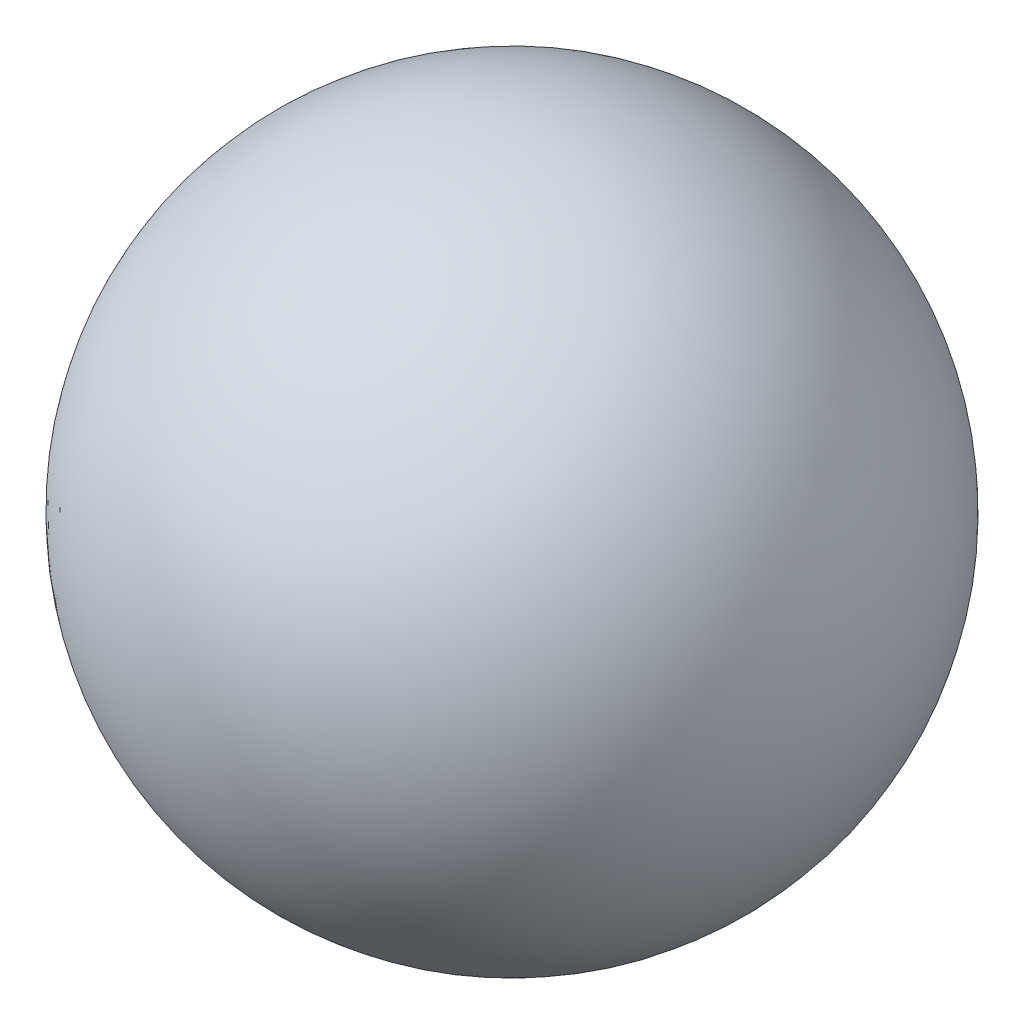
ISO-10303-21;
HEADER;
FILE_DESCRIPTION(('STEP AP214'),'2;1');
FILE_NAME('part.step','',(''),(''),'','','');
FILE_SCHEMA(('AUTOMOTIVE_DESIGN { 1 0 10303 214 1 1 1 1 }'));
ENDSEC;
DATA;
#1=APPLICATION_CONTEXT('core data for automotive mechanical design processes');
#2=APPLICATION_PROTOCOL_DEFINITION('international standard','automotive_design',2000,#1);
#3=PRODUCT_CONTEXT('',#1,'mechanical');
#4=PRODUCT('Part','Part','',(#3));
#5=PRODUCT_RELATED_PRODUCT_CATEGORY('part','',(#4));
#6=PRODUCT_DEFINITION_FORMATION('','',#4);
#7=PRODUCT_DEFINITION_CONTEXT('part definition',#1,'design');
#8=PRODUCT_DEFINITION('design','',#6,#7);
#9=PRODUCT_DEFINITION_SHAPE('','',#8);
#10=(LENGTH_UNIT() NAMED_UNIT(*) SI_UNIT(.MILLI.,.METRE.));
#11=(NAMED_UNIT(*) PLANE_ANGLE_UNIT() SI_UNIT($,.RADIAN.));
#12=(NAMED_UNIT(*) SI_UNIT($,.STERADIAN.) SOLID_ANGLE_UNIT());
#13=UNCERTAINTY_MEASURE_WITH_UNIT(LENGTH_MEASURE(1.E-05),#10,'distance_accuracy_value','');
#14=(GEOMETRIC_REPRESENTATION_CONTEXT(3) GLOBAL_UNCERTAINTY_ASSIGNED_CONTEXT((#13)) GLOBAL_UNIT_ASSIGNED_CONTEXT((#10,
#11,#12)) REPRESENTATION_CONTEXT('',''));
#15=CARTESIAN_POINT('',(0.,0.,0.));
#16=DIRECTION('',(0.,0.,1.));
#17=DIRECTION('',(1.,0.,0.));
#18=AXIS2_PLACEMENT_3D('',#15,#16,#17);
#19=CARTESIAN_POINT('',(0.,0.,0.));
#20=DIRECTION('',(0.638088825741851,0.687826117920667,0.346031619898487));
#21=DIRECTION('',(-0.517881340415058,0.0508322599632402,0.853940863641583));
#22=AXIS2_PLACEMENT_3D('',#19,#20,#21);
#23=SPHERICAL_SURFACE('',#22,0.794);
#24=CARTESIAN_POINT('',(0.50664252763903,0.54613393762901,0.274749106199399));
#25=VERTEX_POINT('',#24);
#26=VERTEX_LOOP('',#25);
#27=FACE_BOUND('',#26,.T.);
#28=CARTESIAN_POINT('',(-0.50664252763903,-0.546133937629009,-0.274749106199399));
#29=VERTEX_POINT('',#28);
#30=VERTEX_LOOP('',#29);
#31=FACE_BOUND('',#30,.T.);
#32=ADVANCED_FACE('F15',(#27,#31),#23,.T.);
#33=CLOSED_SHELL('',(#32));
#34=MANIFOLD_SOLID_BREP('B1',#33);
#35=ADVANCED_BREP_SHAPE_REPRESENTATION('',(#18,#34),#14);
#36=SHAPE_DEFINITION_REPRESENTATION(#9,#35);
ENDSEC;
END-ISO-10303-21;
